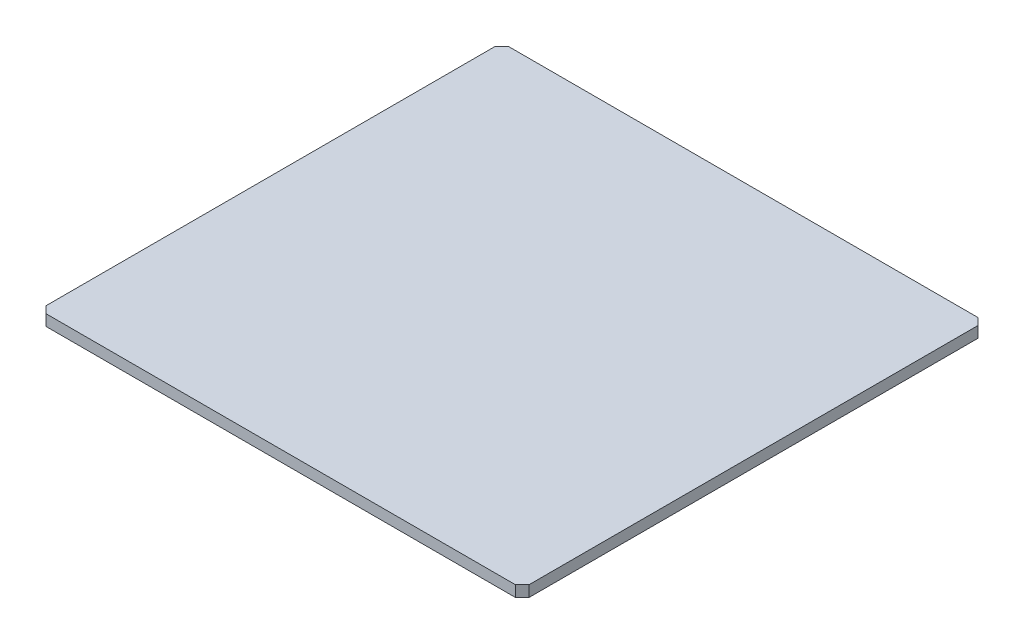
ISO-10303-21;
HEADER;
FILE_DESCRIPTION(('STEP AP214'),'2;1');
FILE_NAME('part.step','',(''),(''),'','','');
FILE_SCHEMA(('AUTOMOTIVE_DESIGN { 1 0 10303 214 1 1 1 1 }'));
ENDSEC;
DATA;
#1=APPLICATION_CONTEXT('core data for automotive mechanical design processes');
#2=APPLICATION_PROTOCOL_DEFINITION('international standard','automotive_design',2000,#1);
#3=PRODUCT_CONTEXT('',#1,'mechanical');
#4=PRODUCT('Part','Part','',(#3));
#5=PRODUCT_RELATED_PRODUCT_CATEGORY('part','',(#4));
#6=PRODUCT_DEFINITION_FORMATION('','',#4);
#7=PRODUCT_DEFINITION_CONTEXT('part definition',#1,'design');
#8=PRODUCT_DEFINITION('design','',#6,#7);
#9=PRODUCT_DEFINITION_SHAPE('','',#8);
#10=(LENGTH_UNIT() NAMED_UNIT(*) SI_UNIT(.MILLI.,.METRE.));
#11=(NAMED_UNIT(*) PLANE_ANGLE_UNIT() SI_UNIT($,.RADIAN.));
#12=(NAMED_UNIT(*) SI_UNIT($,.STERADIAN.) SOLID_ANGLE_UNIT());
#13=UNCERTAINTY_MEASURE_WITH_UNIT(LENGTH_MEASURE(1.E-05),#10,'distance_accuracy_value','');
#14=(GEOMETRIC_REPRESENTATION_CONTEXT(3) GLOBAL_UNCERTAINTY_ASSIGNED_CONTEXT((#13)) GLOBAL_UNIT_ASSIGNED_CONTEXT((#10,
#11,#12)) REPRESENTATION_CONTEXT('',''));
#15=CARTESIAN_POINT('',(0.,0.,0.));
#16=DIRECTION('',(0.,0.,1.));
#17=DIRECTION('',(1.,0.,0.));
#18=AXIS2_PLACEMENT_3D('',#15,#16,#17);
#19=CARTESIAN_POINT('',(0.1017,2.286,-1.41421356237308));
#20=DIRECTION('',(1.,0.,0.));
#21=DIRECTION('',(0.,0.,-1.));
#22=AXIS2_PLACEMENT_3D('',#19,#20,#21);
#23=PLANE('',#22);
#24=DIRECTION('',(0.,0.,1.));
#25=VECTOR('',#24,1.);
#26=CARTESIAN_POINT('',(0.1017,0.,-1.41421356237308));
#27=LINE('',#26,#25);
#28=CARTESIAN_POINT('',(0.1017,0.,-94.1374864376263));
#29=VERTEX_POINT('',#28);
#30=CARTESIAN_POINT('',(0.1017,0.,-1.41421356237308));
#31=VERTEX_POINT('',#30);
#32=EDGE_CURVE('E128',#29,#31,#27,.T.);
#33=ORIENTED_EDGE('',*,*,#32,.T.);
#34=DIRECTION('',(0.,-1.,0.));
#35=VECTOR('',#34,1.);
#36=CARTESIAN_POINT('',(0.1017,2.286,-1.41421356237308));
#37=LINE('',#36,#35);
#38=CARTESIAN_POINT('',(0.1017,2.286,-1.41421356237308));
#39=VERTEX_POINT('',#38);
#40=EDGE_CURVE('E11',#39,#31,#37,.T.);
#41=ORIENTED_EDGE('',*,*,#40,.F.);
#42=DIRECTION('',(0.,0.,1.));
#43=VECTOR('',#42,1.);
#44=CARTESIAN_POINT('',(0.1017,2.286,-1.41421356237308));
#45=LINE('',#44,#43);
#46=CARTESIAN_POINT('',(0.1017,2.286,-94.1374864376263));
#47=VERTEX_POINT('',#46);
#48=EDGE_CURVE('E142',#47,#39,#45,.T.);
#49=ORIENTED_EDGE('',*,*,#48,.F.);
#50=DIRECTION('',(0.,-1.,0.));
#51=VECTOR('',#50,1.);
#52=CARTESIAN_POINT('',(0.1017,2.286,-94.1374864376263));
#53=LINE('',#52,#51);
#54=EDGE_CURVE('E124',#47,#29,#53,.T.);
#55=ORIENTED_EDGE('',*,*,#54,.T.);
#56=EDGE_LOOP('',(#33,#41,#49,#55));
#57=FACE_BOUND('',#56,.T.);
#58=ADVANCED_FACE('F32',(#57),#23,.F.);
#59=CARTESIAN_POINT('',(1.52629252293327,2.286,0.0103789605601707));
#60=DIRECTION('',(0.707106781186543,0.,-0.707106781186552));
#61=DIRECTION('',(-0.707106781186552,0.,-0.707106781186543));
#62=AXIS2_PLACEMENT_3D('',#59,#60,#61);
#63=PLANE('',#62);
#64=DIRECTION('',(0.707106781186552,0.,0.707106781186543));
#65=VECTOR('',#64,1.);
#66=CARTESIAN_POINT('',(1.52629252293327,0.,0.0103789605601707));
#67=LINE('',#66,#65);
#68=CARTESIAN_POINT('',(1.52629252293327,0.,0.0103789605601707));
#69=VERTEX_POINT('',#68);
#70=EDGE_CURVE('E131',#31,#69,#67,.T.);
#71=ORIENTED_EDGE('',*,*,#70,.T.);
#72=DIRECTION('',(0.,-1.,0.));
#73=VECTOR('',#72,1.);
#74=CARTESIAN_POINT('',(1.52629252293327,2.286,0.0103789605601707));
#75=LINE('',#74,#73);
#76=CARTESIAN_POINT('',(1.52629252293327,2.286,0.0103789605601707));
#77=VERTEX_POINT('',#76);
#78=EDGE_CURVE('E40',#77,#69,#75,.T.);
#79=ORIENTED_EDGE('',*,*,#78,.F.);
#80=DIRECTION('',(0.707106781186552,0.,0.707106781186543));
#81=VECTOR('',#80,1.);
#82=CARTESIAN_POINT('',(1.52629252293327,2.286,0.0103789605601707));
#83=LINE('',#82,#81);
#84=EDGE_CURVE('E91',#39,#77,#83,.T.);
#85=ORIENTED_EDGE('',*,*,#84,.F.);
#86=ORIENTED_EDGE('',*,*,#40,.T.);
#87=EDGE_LOOP('',(#71,#79,#85,#86));
#88=FACE_BOUND('',#87,.T.);
#89=ADVANCED_FACE('F177',(#88),#63,.F.);
#90=CARTESIAN_POINT('',(98.4737074770668,2.286,0.0103789605601708));
#91=DIRECTION('',(0.,0.,-1.));
#92=DIRECTION('',(-1.,0.,0.));
#93=AXIS2_PLACEMENT_3D('',#90,#91,#92);
#94=PLANE('',#93);
#95=DIRECTION('',(1.,0.,0.));
#96=VECTOR('',#95,1.);
#97=CARTESIAN_POINT('',(98.4737074770668,0.,0.0103789605601708));
#98=LINE('',#97,#96);
#99=CARTESIAN_POINT('',(98.4737074770668,0.,0.0103789605601708));
#100=VERTEX_POINT('',#99);
#101=EDGE_CURVE('E133',#69,#100,#98,.T.);
#102=ORIENTED_EDGE('',*,*,#101,.T.);
#103=DIRECTION('',(0.,-1.,0.));
#104=VECTOR('',#103,1.);
#105=CARTESIAN_POINT('',(98.4737074770668,2.286,0.0103789605601708));
#106=LINE('',#105,#104);
#107=CARTESIAN_POINT('',(98.4737074770668,2.286,0.0103789605601708));
#108=VERTEX_POINT('',#107);
#109=EDGE_CURVE('E149',#108,#100,#106,.T.);
#110=ORIENTED_EDGE('',*,*,#109,.F.);
#111=DIRECTION('',(1.,0.,0.));
#112=VECTOR('',#111,1.);
#113=CARTESIAN_POINT('',(98.4737074770668,2.286,0.0103789605601708));
#114=LINE('',#113,#112);
#115=EDGE_CURVE('E157',#77,#108,#114,.T.);
#116=ORIENTED_EDGE('',*,*,#115,.F.);
#117=ORIENTED_EDGE('',*,*,#78,.T.);
#118=EDGE_LOOP('',(#102,#110,#116,#117));
#119=FACE_BOUND('',#118,.T.);
#120=ADVANCED_FACE('F155',(#119),#94,.F.);
#121=CARTESIAN_POINT('',(99.8983,2.286,-1.4142135623731));
#122=DIRECTION('',(-0.707106781186552,0.,-0.707106781186543));
#123=DIRECTION('',(-0.707106781186543,0.,0.707106781186552));
#124=AXIS2_PLACEMENT_3D('',#121,#122,#123);
#125=PLANE('',#124);
#126=DIRECTION('',(0.707106781186543,0.,-0.707106781186552));
#127=VECTOR('',#126,1.);
#128=CARTESIAN_POINT('',(99.8983,0.,-1.4142135623731));
#129=LINE('',#128,#127);
#130=CARTESIAN_POINT('',(99.8983,0.,-1.4142135623731));
#131=VERTEX_POINT('',#130);
#132=EDGE_CURVE('E135',#100,#131,#129,.T.);
#133=ORIENTED_EDGE('',*,*,#132,.T.);
#134=DIRECTION('',(0.,-1.,0.));
#135=VECTOR('',#134,1.);
#136=CARTESIAN_POINT('',(99.8983,2.286,-1.4142135623731));
#137=LINE('',#136,#135);
#138=CARTESIAN_POINT('',(99.8983,2.286,-1.4142135623731));
#139=VERTEX_POINT('',#138);
#140=EDGE_CURVE('E146',#139,#131,#137,.T.);
#141=ORIENTED_EDGE('',*,*,#140,.F.);
#142=DIRECTION('',(0.707106781186543,0.,-0.707106781186552));
#143=VECTOR('',#142,1.);
#144=CARTESIAN_POINT('',(99.8983,2.286,-1.4142135623731));
#145=LINE('',#144,#143);
#146=EDGE_CURVE('E169',#108,#139,#145,.T.);
#147=ORIENTED_EDGE('',*,*,#146,.F.);
#148=ORIENTED_EDGE('',*,*,#109,.T.);
#149=EDGE_LOOP('',(#133,#141,#147,#148));
#150=FACE_BOUND('',#149,.T.);
#151=ADVANCED_FACE('F165',(#150),#125,.F.);
#152=CARTESIAN_POINT('',(99.8983,2.286,-94.1374864376263));
#153=DIRECTION('',(-1.,0.,0.));
#154=DIRECTION('',(0.,0.,1.));
#155=AXIS2_PLACEMENT_3D('',#152,#153,#154);
#156=PLANE('',#155);
#157=DIRECTION('',(0.,0.,-1.));
#158=VECTOR('',#157,1.);
#159=CARTESIAN_POINT('',(99.8983,0.,-94.1374864376263));
#160=LINE('',#159,#158);
#161=CARTESIAN_POINT('',(99.8983,0.,-94.1374864376263));
#162=VERTEX_POINT('',#161);
#163=EDGE_CURVE('E137',#131,#162,#160,.T.);
#164=ORIENTED_EDGE('',*,*,#163,.T.);
#165=DIRECTION('',(0.,-1.,0.));
#166=VECTOR('',#165,1.);
#167=CARTESIAN_POINT('',(99.8983,2.286,-94.1374864376263));
#168=LINE('',#167,#166);
#169=CARTESIAN_POINT('',(99.8983,2.286,-94.1374864376263));
#170=VERTEX_POINT('',#169);
#171=EDGE_CURVE('E119',#170,#162,#168,.T.);
#172=ORIENTED_EDGE('',*,*,#171,.F.);
#173=DIRECTION('',(0.,0.,-1.));
#174=VECTOR('',#173,1.);
#175=CARTESIAN_POINT('',(99.8983,2.286,-94.1374864376263));
#176=LINE('',#175,#174);
#177=EDGE_CURVE('E110',#139,#170,#176,.T.);
#178=ORIENTED_EDGE('',*,*,#177,.F.);
#179=ORIENTED_EDGE('',*,*,#140,.T.);
#180=EDGE_LOOP('',(#164,#172,#178,#179));
#181=FACE_BOUND('',#180,.T.);
#182=ADVANCED_FACE('F168',(#181),#156,.F.);
#183=CARTESIAN_POINT('',(98.4737074770667,2.286,-95.5620789605595));
#184=DIRECTION('',(-0.707106781186544,0.,0.707106781186551));
#185=DIRECTION('',(0.707106781186551,0.,0.707106781186544));
#186=AXIS2_PLACEMENT_3D('',#183,#184,#185);
#187=PLANE('',#186);
#188=DIRECTION('',(-0.707106781186551,0.,-0.707106781186544));
#189=VECTOR('',#188,1.);
#190=CARTESIAN_POINT('',(98.4737074770667,0.,-95.5620789605595));
#191=LINE('',#190,#189);
#192=CARTESIAN_POINT('',(98.4737074770667,0.,-95.5620789605595));
#193=VERTEX_POINT('',#192);
#194=EDGE_CURVE('E118',#162,#193,#191,.T.);
#195=ORIENTED_EDGE('',*,*,#194,.T.);
#196=DIRECTION('',(0.,-1.,0.));
#197=VECTOR('',#196,1.);
#198=CARTESIAN_POINT('',(98.4737074770667,2.286,-95.5620789605595));
#199=LINE('',#198,#197);
#200=CARTESIAN_POINT('',(98.4737074770667,2.286,-95.5620789605595));
#201=VERTEX_POINT('',#200);
#202=EDGE_CURVE('E115',#201,#193,#199,.T.);
#203=ORIENTED_EDGE('',*,*,#202,.F.);
#204=DIRECTION('',(-0.707106781186551,0.,-0.707106781186544));
#205=VECTOR('',#204,1.);
#206=CARTESIAN_POINT('',(98.4737074770667,2.286,-95.5620789605595));
#207=LINE('',#206,#205);
#208=EDGE_CURVE('E104',#170,#201,#207,.T.);
#209=ORIENTED_EDGE('',*,*,#208,.F.);
#210=ORIENTED_EDGE('',*,*,#171,.T.);
#211=EDGE_LOOP('',(#195,#203,#209,#210));
#212=FACE_BOUND('',#211,.T.);
#213=ADVANCED_FACE('F116',(#212),#187,.F.);
#214=CARTESIAN_POINT('',(1.52629252293326,2.286,-95.5620789605595));
#215=DIRECTION('',(0.,0.,1.));
#216=DIRECTION('',(1.,0.,0.));
#217=AXIS2_PLACEMENT_3D('',#214,#215,#216);
#218=PLANE('',#217);
#219=DIRECTION('',(-1.,0.,0.));
#220=VECTOR('',#219,1.);
#221=CARTESIAN_POINT('',(1.52629252293326,0.,-95.5620789605595));
#222=LINE('',#221,#220);
#223=CARTESIAN_POINT('',(1.52629252293326,0.,-95.5620789605595));
#224=VERTEX_POINT('',#223);
#225=EDGE_CURVE('E77',#193,#224,#222,.T.);
#226=ORIENTED_EDGE('',*,*,#225,.T.);
#227=DIRECTION('',(0.,-1.,0.));
#228=VECTOR('',#227,1.);
#229=CARTESIAN_POINT('',(1.52629252293326,2.286,-95.5620789605595));
#230=LINE('',#229,#228);
#231=CARTESIAN_POINT('',(1.52629252293326,2.286,-95.5620789605595));
#232=VERTEX_POINT('',#231);
#233=EDGE_CURVE('E120',#232,#224,#230,.T.);
#234=ORIENTED_EDGE('',*,*,#233,.F.);
#235=DIRECTION('',(-1.,0.,0.));
#236=VECTOR('',#235,1.);
#237=CARTESIAN_POINT('',(1.52629252293326,2.286,-95.5620789605595));
#238=LINE('',#237,#236);
#239=EDGE_CURVE('E108',#201,#232,#238,.T.);
#240=ORIENTED_EDGE('',*,*,#239,.F.);
#241=ORIENTED_EDGE('',*,*,#202,.T.);
#242=EDGE_LOOP('',(#226,#234,#240,#241));
#243=FACE_BOUND('',#242,.T.);
#244=ADVANCED_FACE('F122',(#243),#218,.F.);
#245=CARTESIAN_POINT('',(0.1017,2.286,-94.1374864376263));
#246=DIRECTION('',(0.707106781186549,0.,0.707106781186546));
#247=DIRECTION('',(0.707106781186546,0.,-0.707106781186549));
#248=AXIS2_PLACEMENT_3D('',#245,#246,#247);
#249=PLANE('',#248);
#250=DIRECTION('',(-0.707106781186546,0.,0.707106781186549));
#251=VECTOR('',#250,1.);
#252=CARTESIAN_POINT('',(0.1017,0.,-94.1374864376263));
#253=LINE('',#252,#251);
#254=EDGE_CURVE('E83',#224,#29,#253,.T.);
#255=ORIENTED_EDGE('',*,*,#254,.T.);
#256=ORIENTED_EDGE('',*,*,#54,.F.);
#257=DIRECTION('',(-0.707106781186546,0.,0.707106781186549));
#258=VECTOR('',#257,1.);
#259=CARTESIAN_POINT('',(0.1017,2.286,-94.1374864376263));
#260=LINE('',#259,#258);
#261=EDGE_CURVE('E48',#232,#47,#260,.T.);
#262=ORIENTED_EDGE('',*,*,#261,.F.);
#263=ORIENTED_EDGE('',*,*,#233,.T.);
#264=EDGE_LOOP('',(#255,#256,#262,#263));
#265=FACE_BOUND('',#264,.T.);
#266=ADVANCED_FACE('F193',(#265),#249,.F.);
#267=CARTESIAN_POINT('',(0.,2.286,0.));
#268=DIRECTION('',(0.,-1.,0.));
#269=DIRECTION('',(0.,0.,-1.));
#270=AXIS2_PLACEMENT_3D('',#267,#268,#269);
#271=PLANE('',#270);
#272=ORIENTED_EDGE('',*,*,#48,.T.);
#273=ORIENTED_EDGE('',*,*,#84,.T.);
#274=ORIENTED_EDGE('',*,*,#115,.T.);
#275=ORIENTED_EDGE('',*,*,#146,.T.);
#276=ORIENTED_EDGE('',*,*,#177,.T.);
#277=ORIENTED_EDGE('',*,*,#208,.T.);
#278=ORIENTED_EDGE('',*,*,#239,.T.);
#279=ORIENTED_EDGE('',*,*,#261,.T.);
#280=EDGE_LOOP('',(#272,#273,#274,#275,#276,#277,#278,#279));
#281=FACE_BOUND('',#280,.T.);
#282=ADVANCED_FACE('F106',(#281),#271,.F.);
#283=CARTESIAN_POINT('',(0.,0.,0.));
#284=DIRECTION('',(0.,-1.,0.));
#285=DIRECTION('',(0.,0.,-1.));
#286=AXIS2_PLACEMENT_3D('',#283,#284,#285);
#287=PLANE('',#286);
#288=ORIENTED_EDGE('',*,*,#32,.F.);
#289=ORIENTED_EDGE('',*,*,#254,.F.);
#290=ORIENTED_EDGE('',*,*,#225,.F.);
#291=ORIENTED_EDGE('',*,*,#194,.F.);
#292=ORIENTED_EDGE('',*,*,#163,.F.);
#293=ORIENTED_EDGE('',*,*,#132,.F.);
#294=ORIENTED_EDGE('',*,*,#101,.F.);
#295=ORIENTED_EDGE('',*,*,#70,.F.);
#296=EDGE_LOOP('',(#288,#289,#290,#291,#292,#293,#294,#295));
#297=FACE_BOUND('',#296,.T.);
#298=ADVANCED_FACE('F161',(#297),#287,.T.);
#299=CLOSED_SHELL('',(#58,#89,#120,#151,#182,#213,#244,#266,#282,#298));
#300=MANIFOLD_SOLID_BREP('B2',#299);
#301=ADVANCED_BREP_SHAPE_REPRESENTATION('',(#18,#300),#14);
#302=SHAPE_DEFINITION_REPRESENTATION(#9,#301);
ENDSEC;
END-ISO-10303-21;
